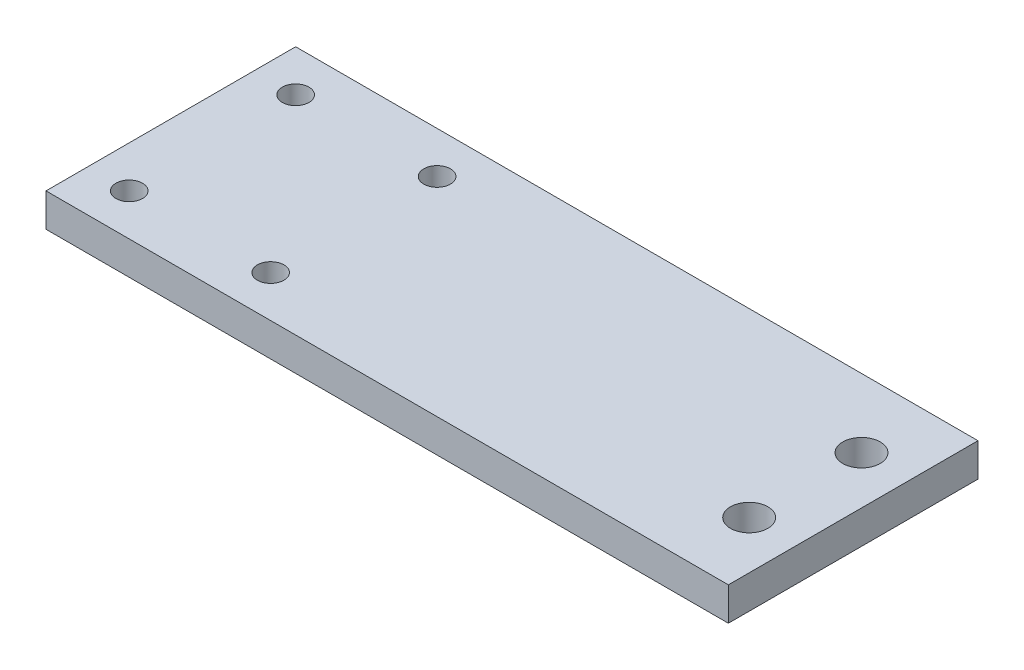
ISO-10303-21;
HEADER;
FILE_DESCRIPTION(('STEP AP214'),'2;1');
FILE_NAME('part.step','',(''),(''),'','','');
FILE_SCHEMA(('AUTOMOTIVE_DESIGN { 1 0 10303 214 1 1 1 1 }'));
ENDSEC;
DATA;
#1=APPLICATION_CONTEXT('core data for automotive mechanical design processes');
#2=APPLICATION_PROTOCOL_DEFINITION('international standard','automotive_design',2000,#1);
#3=PRODUCT_CONTEXT('',#1,'mechanical');
#4=PRODUCT('Part','Part','',(#3));
#5=PRODUCT_RELATED_PRODUCT_CATEGORY('part','',(#4));
#6=PRODUCT_DEFINITION_FORMATION('','',#4);
#7=PRODUCT_DEFINITION_CONTEXT('part definition',#1,'design');
#8=PRODUCT_DEFINITION('design','',#6,#7);
#9=PRODUCT_DEFINITION_SHAPE('','',#8);
#10=(LENGTH_UNIT() NAMED_UNIT(*) SI_UNIT(.MILLI.,.METRE.));
#11=(NAMED_UNIT(*) PLANE_ANGLE_UNIT() SI_UNIT($,.RADIAN.));
#12=(NAMED_UNIT(*) SI_UNIT($,.STERADIAN.) SOLID_ANGLE_UNIT());
#13=UNCERTAINTY_MEASURE_WITH_UNIT(LENGTH_MEASURE(1.E-05),#10,'distance_accuracy_value','');
#14=(GEOMETRIC_REPRESENTATION_CONTEXT(3) GLOBAL_UNCERTAINTY_ASSIGNED_CONTEXT((#13)) GLOBAL_UNIT_ASSIGNED_CONTEXT((#10,
#11,#12)) REPRESENTATION_CONTEXT('',''));
#15=CARTESIAN_POINT('',(0.,0.,0.));
#16=DIRECTION('',(0.,0.,1.));
#17=DIRECTION('',(1.,0.,0.));
#18=AXIS2_PLACEMENT_3D('',#15,#16,#17);
#19=CARTESIAN_POINT('',(0.,4.,0.));
#20=DIRECTION('',(0.,1.,0.));
#21=DIRECTION('',(0.,0.,1.));
#22=AXIS2_PLACEMENT_3D('',#19,#20,#21);
#23=PLANE('',#22);
#24=CARTESIAN_POINT('',(34.25,4.,-16.75));
#25=DIRECTION('',(0.,1.,0.));
#26=DIRECTION('',(0.,0.,1.));
#27=AXIS2_PLACEMENT_3D('',#24,#25,#26);
#28=CIRCLE('',#27,2.25);
#29=CARTESIAN_POINT('',(34.25,4.,-14.5));
#30=VERTEX_POINT('',#29);
#31=EDGE_CURVE('E141',#30,#30,#28,.T.);
#32=ORIENTED_EDGE('',*,*,#31,.F.);
#33=EDGE_LOOP('',(#32));
#34=FACE_BOUND('',#33,.T.);
#35=CARTESIAN_POINT('',(-20.,4.,0.));
#36=DIRECTION('',(0.,1.,0.));
#37=DIRECTION('',(0.,0.,-1.));
#38=AXIS2_PLACEMENT_3D('',#35,#36,#37);
#39=CIRCLE('',#38,1.6);
#40=CARTESIAN_POINT('',(-20.,4.,-1.6));
#41=VERTEX_POINT('',#40);
#42=EDGE_CURVE('E129',#41,#41,#39,.T.);
#43=ORIENTED_EDGE('',*,*,#42,.F.);
#44=EDGE_LOOP('',(#43));
#45=FACE_BOUND('',#44,.T.);
#46=CARTESIAN_POINT('',(-20.,4.,-20.));
#47=DIRECTION('',(0.,1.,0.));
#48=DIRECTION('',(0.,0.,1.));
#49=AXIS2_PLACEMENT_3D('',#46,#47,#48);
#50=CIRCLE('',#49,1.6);
#51=CARTESIAN_POINT('',(-20.,4.,-18.4));
#52=VERTEX_POINT('',#51);
#53=EDGE_CURVE('E108',#52,#52,#50,.T.);
#54=ORIENTED_EDGE('',*,*,#53,.F.);
#55=EDGE_LOOP('',(#54));
#56=FACE_BOUND('',#55,.T.);
#57=DIRECTION('',(1.,0.,0.));
#58=VECTOR('',#57,1.);
#59=CARTESIAN_POINT('',(-42.,4.,4.99999999999999));
#60=LINE('',#59,#58);
#61=CARTESIAN_POINT('',(-42.,4.,4.99999999999999));
#62=VERTEX_POINT('',#61);
#63=CARTESIAN_POINT('',(40.,4.,4.99999999999999));
#64=VERTEX_POINT('',#63);
#65=EDGE_CURVE('E93',#62,#64,#60,.T.);
#66=ORIENTED_EDGE('',*,*,#65,.T.);
#67=DIRECTION('',(0.,0.,-1.));
#68=VECTOR('',#67,1.);
#69=CARTESIAN_POINT('',(40.,4.,4.99999999999999));
#70=LINE('',#69,#68);
#71=CARTESIAN_POINT('',(40.,4.,-25.));
#72=VERTEX_POINT('',#71);
#73=EDGE_CURVE('E88',#64,#72,#70,.T.);
#74=ORIENTED_EDGE('',*,*,#73,.T.);
#75=DIRECTION('',(-1.,0.,0.));
#76=VECTOR('',#75,1.);
#77=CARTESIAN_POINT('',(-42.,4.,-25.));
#78=LINE('',#77,#76);
#79=CARTESIAN_POINT('',(-42.,4.,-25.));
#80=VERTEX_POINT('',#79);
#81=EDGE_CURVE('E91',#72,#80,#78,.T.);
#82=ORIENTED_EDGE('',*,*,#81,.T.);
#83=DIRECTION('',(0.,0.,1.));
#84=VECTOR('',#83,1.);
#85=CARTESIAN_POINT('',(-42.,4.,4.99999999999999));
#86=LINE('',#85,#84);
#87=EDGE_CURVE('E58',#80,#62,#86,.T.);
#88=ORIENTED_EDGE('',*,*,#87,.T.);
#89=EDGE_LOOP('',(#66,#74,#82,#88));
#90=FACE_BOUND('',#89,.T.);
#91=CARTESIAN_POINT('',(-37.,4.,-20.));
#92=DIRECTION('',(0.,1.,0.));
#93=DIRECTION('',(0.,0.,1.));
#94=AXIS2_PLACEMENT_3D('',#91,#92,#93);
#95=CIRCLE('',#94,1.6);
#96=CARTESIAN_POINT('',(-37.,4.,-18.4));
#97=VERTEX_POINT('',#96);
#98=EDGE_CURVE('E123',#97,#97,#95,.T.);
#99=ORIENTED_EDGE('',*,*,#98,.F.);
#100=EDGE_LOOP('',(#99));
#101=FACE_BOUND('',#100,.T.);
#102=CARTESIAN_POINT('',(-37.,4.,0.));
#103=DIRECTION('',(0.,1.,0.));
#104=DIRECTION('',(0.,0.,-1.));
#105=AXIS2_PLACEMENT_3D('',#102,#103,#104);
#106=CIRCLE('',#105,1.59999999999999);
#107=CARTESIAN_POINT('',(-37.,4.,-1.59999999999999));
#108=VERTEX_POINT('',#107);
#109=EDGE_CURVE('E135',#108,#108,#106,.T.);
#110=ORIENTED_EDGE('',*,*,#109,.F.);
#111=EDGE_LOOP('',(#110));
#112=FACE_BOUND('',#111,.T.);
#113=CARTESIAN_POINT('',(34.25,4.,-3.25000000000001));
#114=DIRECTION('',(0.,1.,0.));
#115=DIRECTION('',(0.,0.,-1.));
#116=AXIS2_PLACEMENT_3D('',#113,#114,#115);
#117=CIRCLE('',#116,2.25);
#118=CARTESIAN_POINT('',(34.25,4.,-5.5));
#119=VERTEX_POINT('',#118);
#120=EDGE_CURVE('E147',#119,#119,#117,.T.);
#121=ORIENTED_EDGE('',*,*,#120,.F.);
#122=EDGE_LOOP('',(#121));
#123=FACE_BOUND('',#122,.T.);
#124=ADVANCED_FACE('F41',(#34,#45,#56,#90,#101,#112,#123),#23,.T.);
#125=CARTESIAN_POINT('',(0.,0.,0.));
#126=DIRECTION('',(0.,1.,0.));
#127=DIRECTION('',(0.,0.,1.));
#128=AXIS2_PLACEMENT_3D('',#125,#126,#127);
#129=PLANE('',#128);
#130=DIRECTION('',(1.,0.,0.));
#131=VECTOR('',#130,1.);
#132=CARTESIAN_POINT('',(-42.,0.,4.99999999999999));
#133=LINE('',#132,#131);
#134=CARTESIAN_POINT('',(-42.,0.,4.99999999999999));
#135=VERTEX_POINT('',#134);
#136=CARTESIAN_POINT('',(40.,0.,4.99999999999999));
#137=VERTEX_POINT('',#136);
#138=EDGE_CURVE('E105',#135,#137,#133,.T.);
#139=ORIENTED_EDGE('',*,*,#138,.F.);
#140=DIRECTION('',(0.,0.,1.));
#141=VECTOR('',#140,1.);
#142=CARTESIAN_POINT('',(-42.,0.,4.99999999999999));
#143=LINE('',#142,#141);
#144=CARTESIAN_POINT('',(-42.,0.,-25.));
#145=VERTEX_POINT('',#144);
#146=EDGE_CURVE('E81',#145,#135,#143,.T.);
#147=ORIENTED_EDGE('',*,*,#146,.F.);
#148=DIRECTION('',(-1.,0.,0.));
#149=VECTOR('',#148,1.);
#150=CARTESIAN_POINT('',(-42.,0.,-25.));
#151=LINE('',#150,#149);
#152=CARTESIAN_POINT('',(40.,0.,-25.));
#153=VERTEX_POINT('',#152);
#154=EDGE_CURVE('E75',#153,#145,#151,.T.);
#155=ORIENTED_EDGE('',*,*,#154,.F.);
#156=DIRECTION('',(0.,0.,-1.));
#157=VECTOR('',#156,1.);
#158=CARTESIAN_POINT('',(40.,0.,4.99999999999999));
#159=LINE('',#158,#157);
#160=EDGE_CURVE('E97',#137,#153,#159,.T.);
#161=ORIENTED_EDGE('',*,*,#160,.F.);
#162=EDGE_LOOP('',(#139,#147,#155,#161));
#163=FACE_BOUND('',#162,.T.);
#164=CARTESIAN_POINT('',(-20.,0.,-20.));
#165=DIRECTION('',(0.,1.,0.));
#166=DIRECTION('',(0.,0.,1.));
#167=AXIS2_PLACEMENT_3D('',#164,#165,#166);
#168=CIRCLE('',#167,1.6);
#169=CARTESIAN_POINT('',(-20.,0.,-18.4));
#170=VERTEX_POINT('',#169);
#171=EDGE_CURVE('E120',#170,#170,#168,.T.);
#172=ORIENTED_EDGE('',*,*,#171,.T.);
#173=EDGE_LOOP('',(#172));
#174=FACE_BOUND('',#173,.T.);
#175=CARTESIAN_POINT('',(-37.,0.,-20.));
#176=DIRECTION('',(0.,1.,0.));
#177=DIRECTION('',(0.,0.,1.));
#178=AXIS2_PLACEMENT_3D('',#175,#176,#177);
#179=CIRCLE('',#178,1.6);
#180=CARTESIAN_POINT('',(-37.,0.,-18.4));
#181=VERTEX_POINT('',#180);
#182=EDGE_CURVE('E126',#181,#181,#179,.T.);
#183=ORIENTED_EDGE('',*,*,#182,.T.);
#184=EDGE_LOOP('',(#183));
#185=FACE_BOUND('',#184,.T.);
#186=CARTESIAN_POINT('',(-20.,0.,0.));
#187=DIRECTION('',(0.,1.,0.));
#188=DIRECTION('',(0.,0.,-1.));
#189=AXIS2_PLACEMENT_3D('',#186,#187,#188);
#190=CIRCLE('',#189,1.6);
#191=CARTESIAN_POINT('',(-20.,0.,-1.6));
#192=VERTEX_POINT('',#191);
#193=EDGE_CURVE('E132',#192,#192,#190,.T.);
#194=ORIENTED_EDGE('',*,*,#193,.T.);
#195=EDGE_LOOP('',(#194));
#196=FACE_BOUND('',#195,.T.);
#197=CARTESIAN_POINT('',(-37.,0.,0.));
#198=DIRECTION('',(0.,1.,0.));
#199=DIRECTION('',(0.,0.,-1.));
#200=AXIS2_PLACEMENT_3D('',#197,#198,#199);
#201=CIRCLE('',#200,1.59999999999999);
#202=CARTESIAN_POINT('',(-37.,0.,-1.59999999999999));
#203=VERTEX_POINT('',#202);
#204=EDGE_CURVE('E138',#203,#203,#201,.T.);
#205=ORIENTED_EDGE('',*,*,#204,.T.);
#206=EDGE_LOOP('',(#205));
#207=FACE_BOUND('',#206,.T.);
#208=CARTESIAN_POINT('',(34.25,0.,-16.75));
#209=DIRECTION('',(0.,1.,0.));
#210=DIRECTION('',(0.,0.,1.));
#211=AXIS2_PLACEMENT_3D('',#208,#209,#210);
#212=CIRCLE('',#211,2.25);
#213=CARTESIAN_POINT('',(34.25,0.,-14.5));
#214=VERTEX_POINT('',#213);
#215=EDGE_CURVE('E144',#214,#214,#212,.T.);
#216=ORIENTED_EDGE('',*,*,#215,.T.);
#217=EDGE_LOOP('',(#216));
#218=FACE_BOUND('',#217,.T.);
#219=CARTESIAN_POINT('',(34.25,0.,-3.25000000000001));
#220=DIRECTION('',(0.,1.,0.));
#221=DIRECTION('',(0.,0.,-1.));
#222=AXIS2_PLACEMENT_3D('',#219,#220,#221);
#223=CIRCLE('',#222,2.25);
#224=CARTESIAN_POINT('',(34.25,0.,-5.5));
#225=VERTEX_POINT('',#224);
#226=EDGE_CURVE('E150',#225,#225,#223,.T.);
#227=ORIENTED_EDGE('',*,*,#226,.T.);
#228=EDGE_LOOP('',(#227));
#229=FACE_BOUND('',#228,.T.);
#230=ADVANCED_FACE('F116',(#163,#174,#185,#196,#207,#218,#229),#129,.F.);
#231=CARTESIAN_POINT('',(-42.,4.,4.99999999999999));
#232=DIRECTION('',(0.,0.,-1.));
#233=DIRECTION('',(-1.,0.,0.));
#234=AXIS2_PLACEMENT_3D('',#231,#232,#233);
#235=PLANE('',#234);
#236=ORIENTED_EDGE('',*,*,#138,.T.);
#237=DIRECTION('',(0.,-1.,0.));
#238=VECTOR('',#237,1.);
#239=CARTESIAN_POINT('',(40.,4.,4.99999999999999));
#240=LINE('',#239,#238);
#241=EDGE_CURVE('E11',#64,#137,#240,.T.);
#242=ORIENTED_EDGE('',*,*,#241,.F.);
#243=ORIENTED_EDGE('',*,*,#65,.F.);
#244=DIRECTION('',(0.,-1.,0.));
#245=VECTOR('',#244,1.);
#246=CARTESIAN_POINT('',(-42.,4.,4.99999999999999));
#247=LINE('',#246,#245);
#248=EDGE_CURVE('E101',#62,#135,#247,.T.);
#249=ORIENTED_EDGE('',*,*,#248,.T.);
#250=EDGE_LOOP('',(#236,#242,#243,#249));
#251=FACE_BOUND('',#250,.T.);
#252=ADVANCED_FACE('F43',(#251),#235,.F.);
#253=CARTESIAN_POINT('',(40.,4.,4.99999999999999));
#254=DIRECTION('',(-1.,0.,0.));
#255=DIRECTION('',(0.,0.,1.));
#256=AXIS2_PLACEMENT_3D('',#253,#254,#255);
#257=PLANE('',#256);
#258=ORIENTED_EDGE('',*,*,#160,.T.);
#259=DIRECTION('',(0.,-1.,0.));
#260=VECTOR('',#259,1.);
#261=CARTESIAN_POINT('',(40.,4.,-25.));
#262=LINE('',#261,#260);
#263=EDGE_CURVE('E50',#72,#153,#262,.T.);
#264=ORIENTED_EDGE('',*,*,#263,.F.);
#265=ORIENTED_EDGE('',*,*,#73,.F.);
#266=ORIENTED_EDGE('',*,*,#241,.T.);
#267=EDGE_LOOP('',(#258,#264,#265,#266));
#268=FACE_BOUND('',#267,.T.);
#269=ADVANCED_FACE('F96',(#268),#257,.F.);
#270=CARTESIAN_POINT('',(-42.,4.,-25.));
#271=DIRECTION('',(0.,0.,1.));
#272=DIRECTION('',(1.,0.,0.));
#273=AXIS2_PLACEMENT_3D('',#270,#271,#272);
#274=PLANE('',#273);
#275=ORIENTED_EDGE('',*,*,#154,.T.);
#276=DIRECTION('',(0.,-1.,0.));
#277=VECTOR('',#276,1.);
#278=CARTESIAN_POINT('',(-42.,4.,-25.));
#279=LINE('',#278,#277);
#280=EDGE_CURVE('E98',#80,#145,#279,.T.);
#281=ORIENTED_EDGE('',*,*,#280,.F.);
#282=ORIENTED_EDGE('',*,*,#81,.F.);
#283=ORIENTED_EDGE('',*,*,#263,.T.);
#284=EDGE_LOOP('',(#275,#281,#282,#283));
#285=FACE_BOUND('',#284,.T.);
#286=ADVANCED_FACE('F99',(#285),#274,.F.);
#287=CARTESIAN_POINT('',(-42.,4.,4.99999999999999));
#288=DIRECTION('',(1.,0.,0.));
#289=DIRECTION('',(0.,0.,-1.));
#290=AXIS2_PLACEMENT_3D('',#287,#288,#289);
#291=PLANE('',#290);
#292=ORIENTED_EDGE('',*,*,#146,.T.);
#293=ORIENTED_EDGE('',*,*,#248,.F.);
#294=ORIENTED_EDGE('',*,*,#87,.F.);
#295=ORIENTED_EDGE('',*,*,#280,.T.);
#296=EDGE_LOOP('',(#292,#293,#294,#295));
#297=FACE_BOUND('',#296,.T.);
#298=ADVANCED_FACE('F113',(#297),#291,.F.);
#299=CARTESIAN_POINT('',(-20.,4.,-20.));
#300=DIRECTION('',(0.,-1.,0.));
#301=DIRECTION('',(0.,0.,-1.));
#302=AXIS2_PLACEMENT_3D('',#299,#300,#301);
#303=CYLINDRICAL_SURFACE('',#302,1.6);
#304=ORIENTED_EDGE('',*,*,#53,.T.);
#305=EDGE_LOOP('',(#304));
#306=FACE_BOUND('',#305,.T.);
#307=ORIENTED_EDGE('',*,*,#171,.F.);
#308=EDGE_LOOP('',(#307));
#309=FACE_BOUND('',#308,.T.);
#310=ADVANCED_FACE('F169',(#306,#309),#303,.F.);
#311=CARTESIAN_POINT('',(-37.,4.,-20.));
#312=DIRECTION('',(0.,-1.,0.));
#313=DIRECTION('',(0.,0.,-1.));
#314=AXIS2_PLACEMENT_3D('',#311,#312,#313);
#315=CYLINDRICAL_SURFACE('',#314,1.6);
#316=ORIENTED_EDGE('',*,*,#98,.T.);
#317=EDGE_LOOP('',(#316));
#318=FACE_BOUND('',#317,.T.);
#319=ORIENTED_EDGE('',*,*,#182,.F.);
#320=EDGE_LOOP('',(#319));
#321=FACE_BOUND('',#320,.T.);
#322=ADVANCED_FACE('F223',(#318,#321),#315,.F.);
#323=CARTESIAN_POINT('',(-20.,4.,0.));
#324=DIRECTION('',(0.,-1.,0.));
#325=DIRECTION('',(0.,0.,-1.));
#326=AXIS2_PLACEMENT_3D('',#323,#324,#325);
#327=CYLINDRICAL_SURFACE('',#326,1.6);
#328=ORIENTED_EDGE('',*,*,#42,.T.);
#329=EDGE_LOOP('',(#328));
#330=FACE_BOUND('',#329,.T.);
#331=ORIENTED_EDGE('',*,*,#193,.F.);
#332=EDGE_LOOP('',(#331));
#333=FACE_BOUND('',#332,.T.);
#334=ADVANCED_FACE('F232',(#330,#333),#327,.F.);
#335=CARTESIAN_POINT('',(-37.,4.,0.));
#336=DIRECTION('',(0.,-1.,0.));
#337=DIRECTION('',(0.,0.,-1.));
#338=AXIS2_PLACEMENT_3D('',#335,#336,#337);
#339=CYLINDRICAL_SURFACE('',#338,1.59999999999999);
#340=ORIENTED_EDGE('',*,*,#109,.T.);
#341=EDGE_LOOP('',(#340));
#342=FACE_BOUND('',#341,.T.);
#343=ORIENTED_EDGE('',*,*,#204,.F.);
#344=EDGE_LOOP('',(#343));
#345=FACE_BOUND('',#344,.T.);
#346=ADVANCED_FACE('F241',(#342,#345),#339,.F.);
#347=CARTESIAN_POINT('',(34.25,4.,-16.75));
#348=DIRECTION('',(0.,-1.,0.));
#349=DIRECTION('',(0.,0.,-1.));
#350=AXIS2_PLACEMENT_3D('',#347,#348,#349);
#351=CYLINDRICAL_SURFACE('',#350,2.25);
#352=ORIENTED_EDGE('',*,*,#31,.T.);
#353=EDGE_LOOP('',(#352));
#354=FACE_BOUND('',#353,.T.);
#355=ORIENTED_EDGE('',*,*,#215,.F.);
#356=EDGE_LOOP('',(#355));
#357=FACE_BOUND('',#356,.T.);
#358=ADVANCED_FACE('F251',(#354,#357),#351,.F.);
#359=CARTESIAN_POINT('',(34.25,4.,-3.25000000000001));
#360=DIRECTION('',(0.,-1.,0.));
#361=DIRECTION('',(0.,0.,-1.));
#362=AXIS2_PLACEMENT_3D('',#359,#360,#361);
#363=CYLINDRICAL_SURFACE('',#362,2.25);
#364=ORIENTED_EDGE('',*,*,#120,.T.);
#365=EDGE_LOOP('',(#364));
#366=FACE_BOUND('',#365,.T.);
#367=ORIENTED_EDGE('',*,*,#226,.F.);
#368=EDGE_LOOP('',(#367));
#369=FACE_BOUND('',#368,.T.);
#370=ADVANCED_FACE('F156',(#366,#369),#363,.F.);
#371=CLOSED_SHELL('',(#124,#230,#252,#269,#286,#298,#310,#322,#334,#346,#358,#370));
#372=MANIFOLD_SOLID_BREP('B2',#371);
#373=ADVANCED_BREP_SHAPE_REPRESENTATION('',(#18,#372),#14);
#374=SHAPE_DEFINITION_REPRESENTATION(#9,#373);
ENDSEC;
END-ISO-10303-21;
